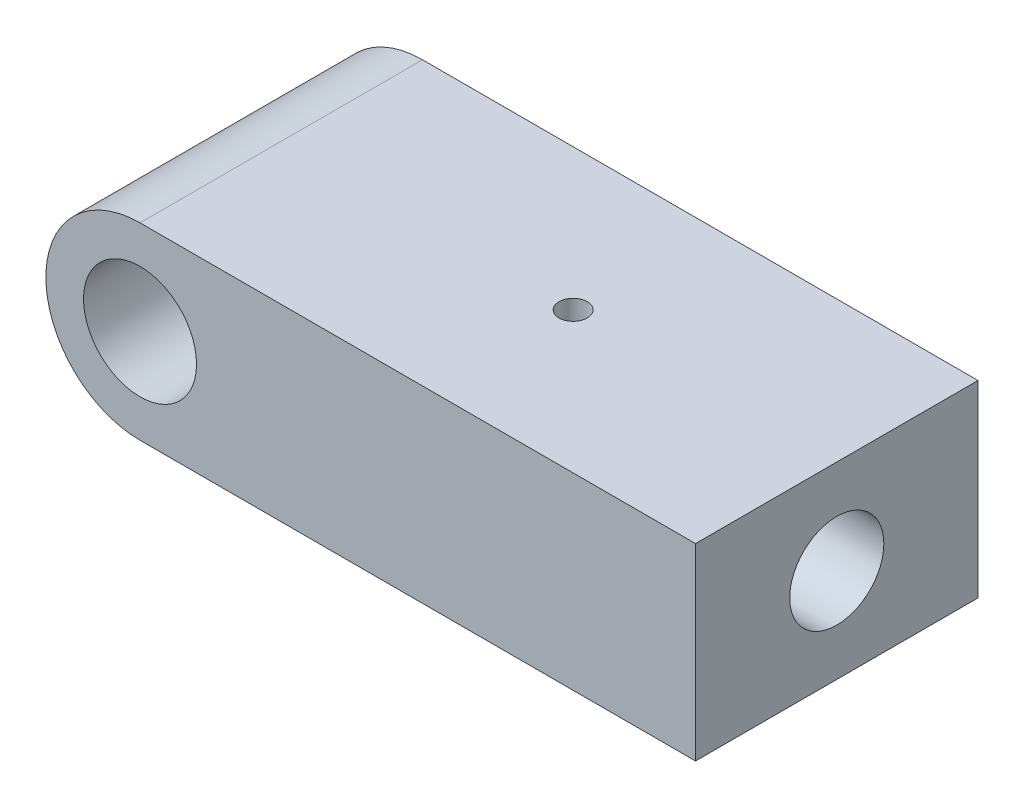
ISO-10303-21;
HEADER;
FILE_DESCRIPTION(('STEP AP214'),'2;1');
FILE_NAME('part.step','',(''),(''),'','','');
FILE_SCHEMA(('AUTOMOTIVE_DESIGN { 1 0 10303 214 1 1 1 1 }'));
ENDSEC;
DATA;
#1=APPLICATION_CONTEXT('core data for automotive mechanical design processes');
#2=APPLICATION_PROTOCOL_DEFINITION('international standard','automotive_design',2000,#1);
#3=PRODUCT_CONTEXT('',#1,'mechanical');
#4=PRODUCT('Part','Part','',(#3));
#5=PRODUCT_RELATED_PRODUCT_CATEGORY('part','',(#4));
#6=PRODUCT_DEFINITION_FORMATION('','',#4);
#7=PRODUCT_DEFINITION_CONTEXT('part definition',#1,'design');
#8=PRODUCT_DEFINITION('design','',#6,#7);
#9=PRODUCT_DEFINITION_SHAPE('','',#8);
#10=(LENGTH_UNIT() NAMED_UNIT(*) SI_UNIT(.MILLI.,.METRE.));
#11=(NAMED_UNIT(*) PLANE_ANGLE_UNIT() SI_UNIT($,.RADIAN.));
#12=(NAMED_UNIT(*) SI_UNIT($,.STERADIAN.) SOLID_ANGLE_UNIT());
#13=UNCERTAINTY_MEASURE_WITH_UNIT(LENGTH_MEASURE(1.E-05),#10,'distance_accuracy_value','');
#14=(GEOMETRIC_REPRESENTATION_CONTEXT(3) GLOBAL_UNCERTAINTY_ASSIGNED_CONTEXT((#13)) GLOBAL_UNIT_ASSIGNED_CONTEXT((#10,
#11,#12)) REPRESENTATION_CONTEXT('',''));
#15=CARTESIAN_POINT('',(0.,0.,0.));
#16=DIRECTION('',(0.,0.,1.));
#17=DIRECTION('',(1.,0.,0.));
#18=AXIS2_PLACEMENT_3D('',#15,#16,#17);
#19=CARTESIAN_POINT('',(0.,0.,15.));
#20=DIRECTION('',(0.,0.,1.));
#21=DIRECTION('',(1.,0.,0.));
#22=AXIS2_PLACEMENT_3D('',#19,#20,#21);
#23=PLANE('',#22);
#24=CARTESIAN_POINT('',(0.,0.,15.));
#25=DIRECTION('',(0.,0.,1.));
#26=DIRECTION('',(1.,0.,0.));
#27=AXIS2_PLACEMENT_3D('',#24,#25,#26);
#28=CIRCLE('',#27,10.);
#29=CARTESIAN_POINT('',(0.,10.,15.));
#30=VERTEX_POINT('',#29);
#31=CARTESIAN_POINT('',(0.,-10.,15.));
#32=VERTEX_POINT('',#31);
#33=EDGE_CURVE('E94',#30,#32,#28,.T.);
#34=ORIENTED_EDGE('',*,*,#33,.T.);
#35=DIRECTION('',(1.,0.,0.));
#36=VECTOR('',#35,1.);
#37=CARTESIAN_POINT('',(0.,-10.,15.));
#38=LINE('',#37,#36);
#39=CARTESIAN_POINT('',(59.,-10.,15.));
#40=VERTEX_POINT('',#39);
#41=EDGE_CURVE('E89',#32,#40,#38,.T.);
#42=ORIENTED_EDGE('',*,*,#41,.T.);
#43=DIRECTION('',(0.,1.,0.));
#44=VECTOR('',#43,1.);
#45=CARTESIAN_POINT('',(59.,10.,15.));
#46=LINE('',#45,#44);
#47=CARTESIAN_POINT('',(59.,10.,15.));
#48=VERTEX_POINT('',#47);
#49=EDGE_CURVE('E92',#40,#48,#46,.T.);
#50=ORIENTED_EDGE('',*,*,#49,.T.);
#51=DIRECTION('',(-1.,0.,0.));
#52=VECTOR('',#51,1.);
#53=CARTESIAN_POINT('',(0.,10.,15.));
#54=LINE('',#53,#52);
#55=EDGE_CURVE('E59',#48,#30,#54,.T.);
#56=ORIENTED_EDGE('',*,*,#55,.T.);
#57=EDGE_LOOP('',(#34,#42,#50,#56));
#58=FACE_BOUND('',#57,.T.);
#59=CARTESIAN_POINT('',(0.,0.,15.));
#60=DIRECTION('',(0.,0.,1.));
#61=DIRECTION('',(1.,0.,0.));
#62=AXIS2_PLACEMENT_3D('',#59,#60,#61);
#63=CIRCLE('',#62,6.);
#64=CARTESIAN_POINT('',(6.,0.,15.));
#65=VERTEX_POINT('',#64);
#66=EDGE_CURVE('E110',#65,#65,#63,.T.);
#67=ORIENTED_EDGE('',*,*,#66,.F.);
#68=EDGE_LOOP('',(#67));
#69=FACE_BOUND('',#68,.T.);
#70=ADVANCED_FACE('F37',(#58,#69),#23,.T.);
#71=CARTESIAN_POINT('',(0.,0.,-15.));
#72=DIRECTION('',(0.,0.,1.));
#73=DIRECTION('',(1.,0.,0.));
#74=AXIS2_PLACEMENT_3D('',#71,#72,#73);
#75=PLANE('',#74);
#76=CARTESIAN_POINT('',(0.,0.,-15.));
#77=DIRECTION('',(0.,0.,1.));
#78=DIRECTION('',(1.,0.,0.));
#79=AXIS2_PLACEMENT_3D('',#76,#77,#78);
#80=CIRCLE('',#79,10.);
#81=CARTESIAN_POINT('',(0.,10.,-15.));
#82=VERTEX_POINT('',#81);
#83=CARTESIAN_POINT('',(0.,-10.,-15.));
#84=VERTEX_POINT('',#83);
#85=EDGE_CURVE('E107',#82,#84,#80,.T.);
#86=ORIENTED_EDGE('',*,*,#85,.F.);
#87=DIRECTION('',(-1.,0.,0.));
#88=VECTOR('',#87,1.);
#89=CARTESIAN_POINT('',(0.,10.,-15.));
#90=LINE('',#89,#88);
#91=CARTESIAN_POINT('',(59.,10.,-15.));
#92=VERTEX_POINT('',#91);
#93=EDGE_CURVE('E82',#92,#82,#90,.T.);
#94=ORIENTED_EDGE('',*,*,#93,.F.);
#95=DIRECTION('',(0.,1.,0.));
#96=VECTOR('',#95,1.);
#97=CARTESIAN_POINT('',(59.,10.,-15.));
#98=LINE('',#97,#96);
#99=CARTESIAN_POINT('',(59.,-10.,-15.));
#100=VERTEX_POINT('',#99);
#101=EDGE_CURVE('E76',#100,#92,#98,.T.);
#102=ORIENTED_EDGE('',*,*,#101,.F.);
#103=DIRECTION('',(1.,0.,0.));
#104=VECTOR('',#103,1.);
#105=CARTESIAN_POINT('',(0.,-10.,-15.));
#106=LINE('',#105,#104);
#107=EDGE_CURVE('E98',#84,#100,#106,.T.);
#108=ORIENTED_EDGE('',*,*,#107,.F.);
#109=EDGE_LOOP('',(#86,#94,#102,#108));
#110=FACE_BOUND('',#109,.T.);
#111=CARTESIAN_POINT('',(0.,0.,-15.));
#112=DIRECTION('',(0.,0.,1.));
#113=DIRECTION('',(1.,0.,0.));
#114=AXIS2_PLACEMENT_3D('',#111,#112,#113);
#115=CIRCLE('',#114,6.);
#116=CARTESIAN_POINT('',(6.,0.,-15.));
#117=VERTEX_POINT('',#116);
#118=EDGE_CURVE('E122',#117,#117,#115,.T.);
#119=ORIENTED_EDGE('',*,*,#118,.T.);
#120=EDGE_LOOP('',(#119));
#121=FACE_BOUND('',#120,.T.);
#122=ADVANCED_FACE('F118',(#110,#121),#75,.F.);
#123=CARTESIAN_POINT('',(0.,0.,15.));
#124=DIRECTION('',(0.,0.,-1.));
#125=DIRECTION('',(-1.,0.,0.));
#126=AXIS2_PLACEMENT_3D('',#123,#124,#125);
#127=CYLINDRICAL_SURFACE('',#126,10.);
#128=ORIENTED_EDGE('',*,*,#85,.T.);
#129=DIRECTION('',(0.,0.,-1.));
#130=VECTOR('',#129,1.);
#131=CARTESIAN_POINT('',(0.,-10.,15.));
#132=LINE('',#131,#130);
#133=EDGE_CURVE('E11',#32,#84,#132,.T.);
#134=ORIENTED_EDGE('',*,*,#133,.F.);
#135=ORIENTED_EDGE('',*,*,#33,.F.);
#136=DIRECTION('',(0.,0.,-1.));
#137=VECTOR('',#136,1.);
#138=CARTESIAN_POINT('',(0.,10.,15.));
#139=LINE('',#138,#137);
#140=EDGE_CURVE('E103',#30,#82,#139,.T.);
#141=ORIENTED_EDGE('',*,*,#140,.T.);
#142=EDGE_LOOP('',(#128,#134,#135,#141));
#143=FACE_BOUND('',#142,.T.);
#144=ADVANCED_FACE('F39',(#143),#127,.T.);
#145=CARTESIAN_POINT('',(0.,-10.,15.));
#146=DIRECTION('',(0.,1.,0.));
#147=DIRECTION('',(0.,0.,1.));
#148=AXIS2_PLACEMENT_3D('',#145,#146,#147);
#149=PLANE('',#148);
#150=ORIENTED_EDGE('',*,*,#107,.T.);
#151=DIRECTION('',(0.,0.,-1.));
#152=VECTOR('',#151,1.);
#153=CARTESIAN_POINT('',(59.,-10.,15.));
#154=LINE('',#153,#152);
#155=EDGE_CURVE('E51',#40,#100,#154,.T.);
#156=ORIENTED_EDGE('',*,*,#155,.F.);
#157=ORIENTED_EDGE('',*,*,#41,.F.);
#158=ORIENTED_EDGE('',*,*,#133,.T.);
#159=EDGE_LOOP('',(#150,#156,#157,#158));
#160=FACE_BOUND('',#159,.T.);
#161=ADVANCED_FACE('F97',(#160),#149,.F.);
#162=CARTESIAN_POINT('',(59.,10.,15.));
#163=DIRECTION('',(-1.,0.,0.));
#164=DIRECTION('',(0.,0.,1.));
#165=AXIS2_PLACEMENT_3D('',#162,#163,#164);
#166=PLANE('',#165);
#167=CARTESIAN_POINT('',(59.,0.,0.));
#168=DIRECTION('',(1.,0.,0.));
#169=DIRECTION('',(0.,0.,-1.));
#170=AXIS2_PLACEMENT_3D('',#167,#168,#169);
#171=CIRCLE('',#170,5.);
#172=CARTESIAN_POINT('',(59.,0.,-5.));
#173=VERTEX_POINT('',#172);
#174=EDGE_CURVE('E130',#173,#173,#171,.T.);
#175=ORIENTED_EDGE('',*,*,#174,.F.);
#176=EDGE_LOOP('',(#175));
#177=FACE_BOUND('',#176,.T.);
#178=ORIENTED_EDGE('',*,*,#101,.T.);
#179=DIRECTION('',(0.,0.,-1.));
#180=VECTOR('',#179,1.);
#181=CARTESIAN_POINT('',(59.,10.,15.));
#182=LINE('',#181,#180);
#183=EDGE_CURVE('E99',#48,#92,#182,.T.);
#184=ORIENTED_EDGE('',*,*,#183,.F.);
#185=ORIENTED_EDGE('',*,*,#49,.F.);
#186=ORIENTED_EDGE('',*,*,#155,.T.);
#187=EDGE_LOOP('',(#178,#184,#185,#186));
#188=FACE_BOUND('',#187,.T.);
#189=ADVANCED_FACE('F101',(#177,#188),#166,.F.);
#190=CARTESIAN_POINT('',(0.,10.,15.));
#191=DIRECTION('',(0.,-1.,0.));
#192=DIRECTION('',(0.,0.,-1.));
#193=AXIS2_PLACEMENT_3D('',#190,#191,#192);
#194=PLANE('',#193);
#195=CARTESIAN_POINT('',(31.,10.,0.));
#196=DIRECTION('',(0.,1.,0.));
#197=DIRECTION('',(0.,0.,1.));
#198=AXIS2_PLACEMENT_3D('',#195,#196,#197);
#199=CIRCLE('',#198,1.49999999999999);
#200=CARTESIAN_POINT('',(31.,10.,1.49999999999999));
#201=VERTEX_POINT('',#200);
#202=EDGE_CURVE('E133',#201,#201,#199,.T.);
#203=ORIENTED_EDGE('',*,*,#202,.F.);
#204=EDGE_LOOP('',(#203));
#205=FACE_BOUND('',#204,.T.);
#206=ORIENTED_EDGE('',*,*,#93,.T.);
#207=ORIENTED_EDGE('',*,*,#140,.F.);
#208=ORIENTED_EDGE('',*,*,#55,.F.);
#209=ORIENTED_EDGE('',*,*,#183,.T.);
#210=EDGE_LOOP('',(#206,#207,#208,#209));
#211=FACE_BOUND('',#210,.T.);
#212=ADVANCED_FACE('F115',(#205,#211),#194,.F.);
#213=CARTESIAN_POINT('',(0.,0.,15.));
#214=DIRECTION('',(0.,0.,-1.));
#215=DIRECTION('',(-1.,0.,0.));
#216=AXIS2_PLACEMENT_3D('',#213,#214,#215);
#217=CYLINDRICAL_SURFACE('',#216,6.);
#218=ORIENTED_EDGE('',*,*,#66,.T.);
#219=EDGE_LOOP('',(#218));
#220=FACE_BOUND('',#219,.T.);
#221=ORIENTED_EDGE('',*,*,#118,.F.);
#222=EDGE_LOOP('',(#221));
#223=FACE_BOUND('',#222,.T.);
#224=ADVANCED_FACE('F157',(#220,#223),#217,.F.);
#225=CARTESIAN_POINT('',(19.,0.,0.));
#226=DIRECTION('',(-1.,0.,0.));
#227=DIRECTION('',(0.,0.,1.));
#228=AXIS2_PLACEMENT_3D('',#225,#226,#227);
#229=PLANE('',#228);
#230=CARTESIAN_POINT('',(19.,0.,0.));
#231=DIRECTION('',(1.,0.,0.));
#232=DIRECTION('',(0.,0.,-1.));
#233=AXIS2_PLACEMENT_3D('',#230,#231,#232);
#234=CIRCLE('',#233,4.99999999999999);
#235=CARTESIAN_POINT('',(19.,0.,-4.99999999999999));
#236=VERTEX_POINT('',#235);
#237=EDGE_CURVE('E125',#236,#236,#234,.T.);
#238=ORIENTED_EDGE('',*,*,#237,.T.);
#239=EDGE_LOOP('',(#238));
#240=FACE_BOUND('',#239,.T.);
#241=ADVANCED_FACE('F148',(#240),#229,.F.);
#242=CARTESIAN_POINT('',(59.,0.,0.));
#243=DIRECTION('',(1.,0.,0.));
#244=DIRECTION('',(0.,0.,-1.));
#245=AXIS2_PLACEMENT_3D('',#242,#243,#244);
#246=CYLINDRICAL_SURFACE('',#245,4.99999999999999);
#247=CARTESIAN_POINT('',(31.,4.76969600708472,1.49999999999999));
#248=CARTESIAN_POINT('',(31.0821945479424,4.76969685726979,1.49999897633763));
#249=CARTESIAN_POINT('',(31.164399224144,4.77184390209068,1.49322108167141));
#250=CARTESIAN_POINT('',(31.3264052495919,4.78016578302899,1.46635844446748));
#251=CARTESIAN_POINT('',(31.4062057865015,4.78634196493467,1.44626925573577));
#252=CARTESIAN_POINT('',(31.5610347282717,4.80196102485632,1.39352753269954));
#253=CARTESIAN_POINT('',(31.6360708296331,4.81139846703232,1.36089589394242));
#254=CARTESIAN_POINT('',(31.7796219339953,4.83246932547567,1.28406421917928));
#255=CARTESIAN_POINT('',(31.8481359586844,4.84410307041019,1.23986245137052));
#256=CARTESIAN_POINT('',(31.9788663905774,4.86866862185765,1.13964754141626));
#257=CARTESIAN_POINT('',(32.0408458979463,4.88162808311635,1.08333207175806));
#258=CARTESIAN_POINT('',(32.1546379513225,4.90714861936756,0.961136237579588));
#259=CARTESIAN_POINT('',(32.2064491904499,4.91970964297704,0.895254645461102));
#260=CARTESIAN_POINT('',(32.2994626998333,4.94333214579388,0.754111437793683));
#261=CARTESIAN_POINT('',(32.3404234244428,4.95435724342404,0.678684021335808));
#262=CARTESIAN_POINT('',(32.4089872590427,4.97334435920684,0.52162464536935));
#263=CARTESIAN_POINT('',(32.4365932498574,4.98130703789495,0.43999402838791));
#264=CARTESIAN_POINT('',(32.4768800010905,4.99307646003589,0.27532385263083));
#265=CARTESIAN_POINT('',(32.4899651276527,4.99699557369338,0.192391398953801));
#266=CARTESIAN_POINT('',(32.5021173246464,5.00063201501347,0.0254218237493157));
#267=CARTESIAN_POINT('',(32.501187339402,5.00035022521078,-0.0586150620503671));
#268=CARTESIAN_POINT('',(32.485607131457,4.99569603817658,-0.222571156600158));
#269=CARTESIAN_POINT('',(32.4713948061901,4.9914542020526,-0.302536267641339));
#270=CARTESIAN_POINT('',(32.4303686640057,4.97951522112592,-0.458889213442523));
#271=CARTESIAN_POINT('',(32.4035540490573,4.97181785750585,-0.535276821322842));
#272=CARTESIAN_POINT('',(32.3377879765814,4.95365220986963,-0.683347326351276));
#273=CARTESIAN_POINT('',(32.2986987971927,4.94315269676705,-0.754965064694473));
#274=CARTESIAN_POINT('',(32.2096021475718,4.92049640648068,-0.890764673783151));
#275=CARTESIAN_POINT('',(32.1595920870365,4.90833923637777,-0.954944774872126));
#276=CARTESIAN_POINT('',(32.0478022492484,4.88311550488165,-1.07666048152979));
#277=CARTESIAN_POINT('',(31.9856430809703,4.8700319532146,-1.13384458040111));
#278=CARTESIAN_POINT('',(31.8524899821099,4.84483979887496,-1.23707651539823));
#279=CARTESIAN_POINT('',(31.7814951746108,4.83273129317019,-1.28312324482852));
#280=CARTESIAN_POINT('',(31.631760530751,4.81077903197677,-1.36313995335449));
#281=CARTESIAN_POINT('',(31.5529529541371,4.80095810695956,-1.39698989237678));
#282=CARTESIAN_POINT('',(31.3903927915545,4.78496392548436,-1.45083362878412));
#283=CARTESIAN_POINT('',(31.3066418284654,4.77878947915829,-1.47083194640559));
#284=CARTESIAN_POINT('',(31.1399176392607,4.77104849541241,-1.49574770282164));
#285=CARTESIAN_POINT('',(31.057031776106,4.7693187867044,-1.50119946380211));
#286=CARTESIAN_POINT('',(30.8915270999901,4.77021192441923,-1.49835947233061));
#287=CARTESIAN_POINT('',(30.8089082512692,4.77283416156589,-1.49006964371329));
#288=CARTESIAN_POINT('',(30.6485116220291,4.78197558554912,-1.46045763574189));
#289=CARTESIAN_POINT('',(30.5706638357365,4.78839176507488,-1.43947961431279));
#290=CARTESIAN_POINT('',(30.4195983091851,4.80429141231227,-1.38548577747939));
#291=CARTESIAN_POINT('',(30.3463812858594,4.81377535359073,-1.35246810342759));
#292=CARTESIAN_POINT('',(30.2044825359279,4.83505835023047,-1.274318711965));
#293=CARTESIAN_POINT('',(30.1359752790142,4.84691271069798,-1.22888564172728));
#294=CARTESIAN_POINT('',(30.0073618938192,4.87148205646987,-1.12755301600384));
#295=CARTESIAN_POINT('',(29.9472577823872,4.88419724730003,-1.07165095534896));
#296=CARTESIAN_POINT('',(29.8348195941853,4.90963633548157,-0.948455132493592));
#297=CARTESIAN_POINT('',(29.782864371013,4.92234245063003,-0.880811065857429));
#298=CARTESIAN_POINT('',(29.6910332989723,4.9458485174865,-0.737461784590244));
#299=CARTESIAN_POINT('',(29.6511568502185,4.95664856384716,-0.661756970543939));
#300=CARTESIAN_POINT('',(29.5849999694317,4.97505970474957,-0.504935504705217));
#301=CARTESIAN_POINT('',(29.558617983841,4.98269453424965,-0.423864622037835));
#302=CARTESIAN_POINT('',(29.5199390811096,4.99401979596826,-0.258169966504586));
#303=CARTESIAN_POINT('',(29.5076381340516,4.99771135670879,-0.173547217354762));
#304=CARTESIAN_POINT('',(29.4977769559455,5.00066544081399,-0.00665215388274318));
#305=CARTESIAN_POINT('',(29.4996673045922,5.00009305111321,0.0755851790862057));
#306=CARTESIAN_POINT('',(29.5168216324991,4.99497264465036,0.238519481164402));
#307=CARTESIAN_POINT('',(29.5320848534804,4.99042485330462,0.319216537346526));
#308=CARTESIAN_POINT('',(29.5752116613996,4.97791168358326,0.475935813041354));
#309=CARTESIAN_POINT('',(29.602938180649,4.96998352900865,0.551998927351387));
#310=CARTESIAN_POINT('',(29.6700819145072,4.95152943039449,0.698433237752048));
#311=CARTESIAN_POINT('',(29.7095010502862,4.94100305949946,0.768803496050574));
#312=CARTESIAN_POINT('',(29.80037345743,4.91803965828228,0.904301892420557));
#313=CARTESIAN_POINT('',(29.8521714300008,4.90555226923559,0.96919025007676));
#314=CARTESIAN_POINT('',(29.9657103883328,4.88023537212333,1.08953757134594));
#315=CARTESIAN_POINT('',(30.0274542378982,4.86740576641079,1.14499380960193));
#316=CARTESIAN_POINT('',(30.1613407783105,4.84240680631319,1.24656269394548));
#317=CARTESIAN_POINT('',(30.2337385533904,4.83026852693485,1.29234759757955));
#318=CARTESIAN_POINT('',(30.385555174161,4.80852547508792,1.37104313528775));
#319=CARTESIAN_POINT('',(30.4649706236012,4.79891948596955,1.40395995557288));
#320=CARTESIAN_POINT('',(30.6197404316063,4.78427816717594,1.45301942532949));
#321=CARTESIAN_POINT('',(30.694608646931,4.77886154840519,1.47058859011231));
#322=CARTESIAN_POINT('',(30.8463152224958,4.77157042597166,1.49407818835143));
#323=CARTESIAN_POINT('',(30.9231531846452,4.7696952122143,1.50000095706094));
#324=CARTESIAN_POINT('',(31.,4.76969600708472,1.49999999999999));
#325=B_SPLINE_CURVE_WITH_KNOTS('',3,(#247,#248,#249,#250,#251,#252,#253,#254,#255,#256,#257,
#258,#259,#260,#261,#262,#263,#264,#265,#266,#267,#268,#269,#270,#271,#272,#273,#274,#275,#276,
#277,#278,#279,#280,#281,#282,#283,#284,#285,#286,#287,#288,#289,#290,#291,#292,#293,#294,#295,
#296,#297,#298,#299,#300,#301,#302,#303,#304,#305,#306,#307,#308,#309,#310,#311,#312,#313,#314,
#315,#316,#317,#318,#319,#320,#321,#322,#323,#324),.UNSPECIFIED.,.T.,.F.,(4,2,2,2,2,2,2,2,2,2,2,
2,2,2,2,2,2,2,2,2,2,2,2,2,2,2,2,2,2,2,2,2,2,2,2,2,2,2,4),(0.,0.246300165915542,
0.492682641688997,0.738656414466195,0.984667025370094,1.23773150007984,1.49082847871272,
1.74915939273644,2.00743455587876,2.25832140149556,2.50915554101439,2.75200125990878,
2.99486235890374,3.24055209335674,3.48630016590828,3.74152147023276,3.9967681249186,
4.25446238246264,4.51207250628408,4.76008080790306,5.00805439107385,5.24958594938814,
5.49115481045784,5.73920731809385,5.98731925928919,6.24479506100598,6.50225807324198,
6.75775391814321,7.01317662321678,7.25876303911216,7.5043355304775,7.74727096872214,
7.99024634491373,8.24099627054483,8.49181852629885,8.75011639669142,9.00828993963939,
9.23861153857441,9.46888695033554),.UNSPECIFIED.);
#326=CARTESIAN_POINT('',(31.,4.76969600708472,1.49999999999999));
#327=VERTEX_POINT('',#326);
#328=EDGE_CURVE('E41',#327,#327,#325,.T.);
#329=ORIENTED_EDGE('',*,*,#328,.T.);
#330=EDGE_LOOP('',(#329));
#331=FACE_BOUND('',#330,.T.);
#332=ORIENTED_EDGE('',*,*,#237,.F.);
#333=EDGE_LOOP('',(#332));
#334=FACE_BOUND('',#333,.T.);
#335=ORIENTED_EDGE('',*,*,#174,.T.);
#336=EDGE_LOOP('',(#335));
#337=FACE_BOUND('',#336,.T.);
#338=ADVANCED_FACE('F140',(#331,#334,#337),#246,.F.);
#339=CARTESIAN_POINT('',(31.,10.,0.));
#340=DIRECTION('',(0.,1.,0.));
#341=DIRECTION('',(0.,0.,1.));
#342=AXIS2_PLACEMENT_3D('',#339,#340,#341);
#343=CYLINDRICAL_SURFACE('',#342,1.49999999999999);
#344=ORIENTED_EDGE('',*,*,#202,.T.);
#345=EDGE_LOOP('',(#344));
#346=FACE_BOUND('',#345,.T.);
#347=ORIENTED_EDGE('',*,*,#328,.F.);
#348=EDGE_LOOP('',(#347));
#349=FACE_BOUND('',#348,.T.);
#350=ADVANCED_FACE('F143',(#346,#349),#343,.F.);
#351=CLOSED_SHELL('',(#70,#122,#144,#161,#189,#212,#224,#241,#338,#350));
#352=MANIFOLD_SOLID_BREP('B2',#351);
#353=ADVANCED_BREP_SHAPE_REPRESENTATION('',(#18,#352),#14);
#354=SHAPE_DEFINITION_REPRESENTATION(#9,#353);
ENDSEC;
END-ISO-10303-21;
